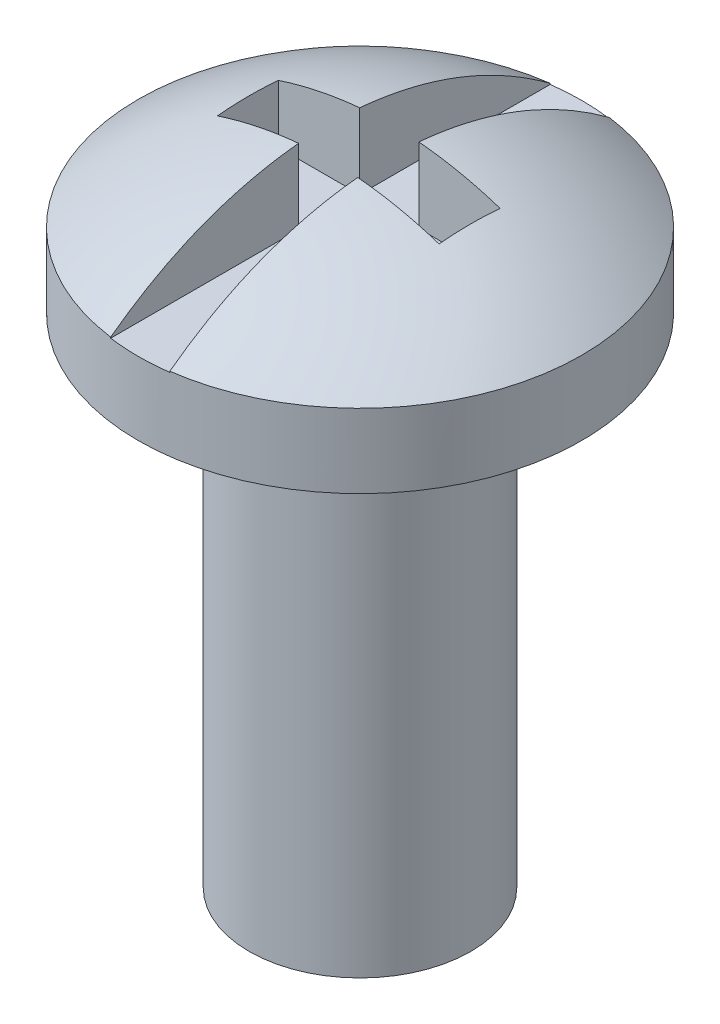
ISO-10303-21;
HEADER;
FILE_DESCRIPTION(('STEP AP214'),'2;1');
FILE_NAME('part.step','',(''),(''),'','','');
FILE_SCHEMA(('AUTOMOTIVE_DESIGN { 1 0 10303 214 1 1 1 1 }'));
ENDSEC;
DATA;
#1=APPLICATION_CONTEXT('core data for automotive mechanical design processes');
#2=APPLICATION_PROTOCOL_DEFINITION('international standard','automotive_design',2000,#1);
#3=PRODUCT_CONTEXT('',#1,'mechanical');
#4=PRODUCT('Part','Part','',(#3));
#5=PRODUCT_RELATED_PRODUCT_CATEGORY('part','',(#4));
#6=PRODUCT_DEFINITION_FORMATION('','',#4);
#7=PRODUCT_DEFINITION_CONTEXT('part definition',#1,'design');
#8=PRODUCT_DEFINITION('design','',#6,#7);
#9=PRODUCT_DEFINITION_SHAPE('','',#8);
#10=(LENGTH_UNIT() NAMED_UNIT(*) SI_UNIT(.MILLI.,.METRE.));
#11=(NAMED_UNIT(*) PLANE_ANGLE_UNIT() SI_UNIT($,.RADIAN.));
#12=(NAMED_UNIT(*) SI_UNIT($,.STERADIAN.) SOLID_ANGLE_UNIT());
#13=UNCERTAINTY_MEASURE_WITH_UNIT(LENGTH_MEASURE(1.E-05),#10,'distance_accuracy_value','');
#14=(GEOMETRIC_REPRESENTATION_CONTEXT(3) GLOBAL_UNCERTAINTY_ASSIGNED_CONTEXT((#13)) GLOBAL_UNIT_ASSIGNED_CONTEXT((#10,
#11,#12)) REPRESENTATION_CONTEXT('',''));
#15=CARTESIAN_POINT('',(0.,0.,0.));
#16=DIRECTION('',(0.,0.,1.));
#17=DIRECTION('',(1.,0.,0.));
#18=AXIS2_PLACEMENT_3D('',#15,#16,#17);
#19=CARTESIAN_POINT('',(0.,1.05624720814746,0.));
#20=CARTESIAN_POINT('',(-1.65504595994143,1.02014151907972,0.));
#21=CARTESIAN_POINT('',(-2.99999999999999,0.0131313521263424,0.));
#22=B_SPLINE_CURVE_WITH_KNOTS('',2,(#19,#20,#21),.UNSPECIFIED.,.F.,.F.,(3,3),(0.,
0.690587556508818),.UNSPECIFIED.);
#23=CARTESIAN_POINT('',(0.,54.4769452525927,0.));
#24=DIRECTION('',(0.,1.,0.));
#25=AXIS1_PLACEMENT('',#23,#24);
#26=SURFACE_OF_REVOLUTION('',#22,#25);
#27=CARTESIAN_POINT('',(1.5,0.783289571251429,0.430409259743653));
#28=CARTESIAN_POINT('',(1.3466391247065,0.833941776803077,0.430409259743659));
#29=CARTESIAN_POINT('',(1.19072307643197,0.877033538968349,0.430409259743657));
#30=CARTESIAN_POINT('',(0.876299651897131,0.947523998620973,0.43040925974365));
#31=CARTESIAN_POINT('',(0.717811639327711,0.975009095165208,0.430409259743646));
#32=CARTESIAN_POINT('',(0.50569781423859,1.00114357564236,0.430409259743649));
#33=CARTESIAN_POINT('',(0.452884215118986,1.00678042463389,0.43040925974365));
#34=CARTESIAN_POINT('',(0.39999999999999,1.01155260292836,0.430409259743653));
#35=B_SPLINE_CURVE_WITH_KNOTS('',3,(#27,#28,#29,#30,#31,#32,#33,#34),.UNSPECIFIED.,.F.,.F.,(4,2,
2,4),(0.,0.4844448005527,0.966180874368142,1.12549189581723),.UNSPECIFIED.);
#36=CARTESIAN_POINT('',(1.5,0.783289571251429,0.430409259743653));
#37=VERTEX_POINT('',#36);
#38=CARTESIAN_POINT('',(0.400000000000001,1.01155260292836,0.430409259743653));
#39=VERTEX_POINT('',#38);
#40=EDGE_CURVE('E11',#37,#39,#35,.T.);
#41=ORIENTED_EDGE('',*,*,#40,.T.);
#42=CARTESIAN_POINT('',(0.400000000000001,1.01155260292836,0.430409259743653));
#43=CARTESIAN_POINT('',(0.400000000000001,1.00425074679952,0.505657596346426));
#44=CARTESIAN_POINT('',(0.400000000000001,0.995209486998079,0.58073542753754));
#45=CARTESIAN_POINT('',(0.400000000000001,0.973689293816939,0.730387537298188));
#46=CARTESIAN_POINT('',(0.400000000000001,0.961210781161484,0.80496187635203));
#47=CARTESIAN_POINT('',(0.400000000000001,0.933029534566896,0.952551031900024));
#48=CARTESIAN_POINT('',(0.400000000000001,0.917368281483544,1.02557375320249));
#49=CARTESIAN_POINT('',(0.400000000000001,0.882744893862674,1.17083770489729));
#50=CARTESIAN_POINT('',(0.400000000000001,0.863782271788907,1.24307881818812));
#51=CARTESIAN_POINT('',(0.400000000000001,0.800870462385377,1.46225182002903));
#52=CARTESIAN_POINT('',(0.400000000000001,0.75164086595195,1.60770809256805));
#53=CARTESIAN_POINT('',(0.400000000000001,0.639863646969604,1.89350266130827));
#54=CARTESIAN_POINT('',(0.400000000000001,0.577305155645242,2.03383667061332));
#55=CARTESIAN_POINT('',(0.400000000000001,0.438046557607226,2.31183343502476));
#56=CARTESIAN_POINT('',(0.400000000000001,0.361025171343869,2.44933560907898));
#57=CARTESIAN_POINT('',(0.400000000000001,0.236794923851009,2.65003307593094));
#58=CARTESIAN_POINT('',(0.400000000000001,0.193954802753135,2.71597994762657));
#59=CARTESIAN_POINT('',(0.400000000000001,0.105547183660501,2.84600332544675));
#60=CARTESIAN_POINT('',(0.400000000000001,0.0599801742261693,2.91008016357184));
#61=CARTESIAN_POINT('',(0.400000000000001,0.0131313521263424,2.97321374946369));
#62=B_SPLINE_CURVE_WITH_KNOTS('',3,(#42,#43,#44,#45,#46,#47,#48,#49,#50,#51,#52,#53,#54,#55,#56,
#57,#58,#59,#60,#61),.UNSPECIFIED.,.F.,.F.,(4,2,2,2,2,2,2,2,2,4),(0.,0.226782284458679,
0.453536822794671,0.677506450695945,0.901509181857664,1.3614544654574,1.82177624735166,
2.29389289523833,2.52975478003197,2.76557453263477),.UNSPECIFIED.);
#63=CARTESIAN_POINT('',(0.400000000000001,0.0131313521263415,2.97321374946369));
#64=VERTEX_POINT('',#63);
#65=EDGE_CURVE('E132',#39,#64,#62,.T.);
#66=ORIENTED_EDGE('',*,*,#65,.T.);
#67=CARTESIAN_POINT('',(0.,0.0131313521263415,0.));
#68=DIRECTION('',(0.,1.,0.));
#69=DIRECTION('',(0.,0.,1.));
#70=AXIS2_PLACEMENT_3D('',#67,#68,#69);
#71=CIRCLE('',#70,2.99999999999999);
#72=CARTESIAN_POINT('',(0.4,0.0131313521263415,-2.97321374946369));
#73=VERTEX_POINT('',#72);
#74=EDGE_CURVE('E324',#64,#73,#71,.T.);
#75=ORIENTED_EDGE('',*,*,#74,.T.);
#76=CARTESIAN_POINT('',(0.4,0.013131352126342,-2.97321374946369));
#77=CARTESIAN_POINT('',(0.400000000000001,0.113835718494808,-2.83757097844883));
#78=CARTESIAN_POINT('',(0.4,0.208577884231259,-2.69749190479062));
#79=CARTESIAN_POINT('',(0.4,0.339925015446915,-2.48217851347155));
#80=CARTESIAN_POINT('',(0.4,0.381665388531384,-2.41004816713678));
#81=CARTESIAN_POINT('',(0.4,0.461650203549989,-2.26385913894055));
#82=CARTESIAN_POINT('',(0.400000000000001,0.499894096005798,-2.18980015633196));
#83=CARTESIAN_POINT('',(0.400000000000001,0.600813616496412,-1.98198757256186));
#84=CARTESIAN_POINT('',(0.4,0.659554102390821,-1.84629352675607));
#85=CARTESIAN_POINT('',(0.4,0.764662564875223,-1.57014139986353));
#86=CARTESIAN_POINT('',(0.4,0.811025337738785,-1.42968134297487));
#87=CARTESIAN_POINT('',(0.4,0.891877911851409,-1.14171151190978));
#88=CARTESIAN_POINT('',(0.4,0.926053602165833,-0.994113400232879));
#89=CARTESIAN_POINT('',(0.4,0.980729999187133,-0.696417984508175));
#90=CARTESIAN_POINT('',(0.4,1.0012318482514,-0.54632089030765));
#91=CARTESIAN_POINT('',(0.400000000000001,1.01479556007135,-0.39560585054899));
#92=B_SPLINE_CURVE_WITH_KNOTS('',3,(#76,#77,#78,#79,#80,#81,#82,#83,#84,#85,#86,#87,#88,#89,#90,
#91),.UNSPECIFIED.,.F.,.F.,(4,2,2,2,2,2,2,4),(0.,0.50659170584198,0.756518211062741,
1.00648392542032,1.44944984227423,1.89260169464805,2.34646630417434,2.80029299161653),.UNSPECIFIED.);
#93=CARTESIAN_POINT('',(0.4,1.01479556007135,-0.39560585054899));
#94=VERTEX_POINT('',#93);
#95=EDGE_CURVE('E256',#73,#94,#92,.T.);
#96=ORIENTED_EDGE('',*,*,#95,.T.);
#97=CARTESIAN_POINT('',(0.4,1.01479556007135,-0.39560585054899));
#98=CARTESIAN_POINT('',(0.549098771798424,1.00124330316207,-0.39560585054899));
#99=CARTESIAN_POINT('',(0.697608561758349,0.980886434426537,-0.39560585054899));
#100=CARTESIAN_POINT('',(0.991411817871552,0.926934502781349,-0.39560585054899));
#101=CARTESIAN_POINT('',(1.13671791568161,0.89340820785117,-0.39560585054899));
#102=CARTESIAN_POINT('',(1.3539690518688,0.832784753519446,-0.39560585054899));
#103=CARTESIAN_POINT('',(1.42727155370484,0.810472286121609,-0.39560585054899));
#104=CARTESIAN_POINT('',(1.5,0.786454045439858,-0.39560585054899));
#105=B_SPLINE_CURVE_WITH_KNOTS('',3,(#97,#98,#99,#100,#101,#102,#103,#104),.UNSPECIFIED.,.F.,
.F.,(4,2,2,4),(0.,0.449046043208007,0.895777784162428,1.1255606403534),.UNSPECIFIED.);
#106=CARTESIAN_POINT('',(1.5,0.786454045439858,-0.39560585054899));
#107=VERTEX_POINT('',#106);
#108=EDGE_CURVE('E234',#94,#107,#105,.T.);
#109=ORIENTED_EDGE('',*,*,#108,.T.);
#110=CARTESIAN_POINT('',(1.5,0.786454045439858,-0.39560585054899));
#111=CARTESIAN_POINT('',(1.5,0.798425783812092,-0.257888781097871));
#112=CARTESIAN_POINT('',(1.5,0.80414794681584,-0.120195653847924));
#113=CARTESIAN_POINT('',(1.5,0.803093122086364,0.155142716249623));
#114=CARTESIAN_POINT('',(1.5,0.79631613435314,0.292787959097225));
#115=CARTESIAN_POINT('',(1.5,0.78328957125143,0.430409259743653));
#116=B_SPLINE_CURVE_WITH_KNOTS('',3,(#110,#111,#112,#113,#114,#115),.UNSPECIFIED.,.F.,.F.,(4,2,
4),(0.,0.413435924868416,0.826871849736832),.UNSPECIFIED.);
#117=EDGE_CURVE('E46',#107,#37,#116,.T.);
#118=ORIENTED_EDGE('',*,*,#117,.T.);
#119=EDGE_LOOP('',(#41,#66,#75,#96,#109,#118));
#120=FACE_BOUND('',#119,.T.);
#121=ADVANCED_FACE('F32',(#120),#26,.F.);
#122=CARTESIAN_POINT('',(-1.49999999999999,0.786454045439869,-0.395605850549037));
#123=CARTESIAN_POINT('',(-1.34666421706277,0.837078035331176,-0.395605850549013));
#124=CARTESIAN_POINT('',(-1.19077950750411,0.880140053645199,-0.395605850548998));
#125=CARTESIAN_POINT('',(-0.876421065619345,0.950613575159147,-0.395605850548981));
#126=CARTESIAN_POINT('',(-0.717966515504543,0.978110652678506,-0.39560585054898));
#127=CARTESIAN_POINT('',(-0.50582492540966,1.00432554074677,-0.395605850548985));
#128=CARTESIAN_POINT('',(-0.452947757187914,1.00999146096424,-0.395605850548987));
#129=CARTESIAN_POINT('',(-0.399999999999987,1.01479556007135,-0.395605850548989));
#130=B_SPLINE_CURVE_WITH_KNOTS('',3,(#122,#123,#124,#125,#126,#127,#128,#129),.UNSPECIFIED.,.F.,
.F.,(4,2,2,4),(0.,0.484338165759318,0.965986965728526,1.125496907751),.UNSPECIFIED.);
#131=CARTESIAN_POINT('',(-1.5,0.786454045439869,-0.39560585054899));
#132=VERTEX_POINT('',#131);
#133=CARTESIAN_POINT('',(-0.4,1.01479556007135,-0.39560585054899));
#134=VERTEX_POINT('',#133);
#135=EDGE_CURVE('E227',#132,#134,#130,.T.);
#136=ORIENTED_EDGE('',*,*,#135,.T.);
#137=CARTESIAN_POINT('',(-0.4,1.01479556007135,-0.39560585054899));
#138=CARTESIAN_POINT('',(-0.4,1.00812450546121,-0.46993658968422));
#139=CARTESIAN_POINT('',(-0.4,0.999752556517969,-0.544101921640514));
#140=CARTESIAN_POINT('',(-0.4,0.979649123102281,-0.691962319332855));
#141=CARTESIAN_POINT('',(-0.4,0.967918248848191,-0.765657468003684));
#142=CARTESIAN_POINT('',(-0.4,0.927707396511351,-0.986080707721143));
#143=CARTESIAN_POINT('',(-0.4,0.894228650445375,-1.13193148048177));
#144=CARTESIAN_POINT('',(-0.4,0.816766836851975,-1.41044167638845));
#145=CARTESIAN_POINT('',(-0.399999999999999,0.773622477986334,-1.54333656904702));
#146=CARTESIAN_POINT('',(-0.4,0.676207470249333,-1.80505187754341));
#147=CARTESIAN_POINT('',(-0.400000000000001,0.621932194268059,-1.93387057312146));
#148=CARTESIAN_POINT('',(-0.399999999999998,0.502957219619231,-2.18647439864768));
#149=CARTESIAN_POINT('',(-0.399999999999995,0.438264530263261,-2.31026284352865));
#150=CARTESIAN_POINT('',(-0.400000000000005,0.299308960679265,-2.55227032799066));
#151=CARTESIAN_POINT('',(-0.400000000000019,0.225050878684738,-2.67049211961179));
#152=CARTESIAN_POINT('',(-0.399999999999995,0.124906391603568,-2.81745691898785));
#153=CARTESIAN_POINT('',(-0.399999999999987,0.102972777262155,-2.84894504656958));
#154=CARTESIAN_POINT('',(-0.400000000000012,0.0585043204636868,-2.91143379537133));
#155=CARTESIAN_POINT('',(-0.400000000000045,0.0359702757207004,-2.9424349841788));
#156=CARTESIAN_POINT('',(-0.400000000000121,0.0131313521263424,-2.97321374946367));
#157=B_SPLINE_CURVE_WITH_KNOTS('',3,(#137,#138,#139,#140,#141,#142,#143,#144,#145,#146,#147,
#148,#149,#150,#151,#152,#153,#154,#155,#156),.UNSPECIFIED.,.F.,.F.,(4,2,2,2,2,2,2,2,2,4),(0.,
0.22384419171404,0.447647743267862,0.895900452706192,1.31458079828997,1.73343554290504,
2.15200963153011,2.57037456496726,2.68549299872071,2.80046544627719),.UNSPECIFIED.);
#158=CARTESIAN_POINT('',(-0.4,0.0131313521263415,-2.97321374946369));
#159=VERTEX_POINT('',#158);
#160=EDGE_CURVE('E188',#134,#159,#157,.T.);
#161=ORIENTED_EDGE('',*,*,#160,.T.);
#162=CARTESIAN_POINT('',(-0.399999999999999,0.0131313521263415,2.97321374946369));
#163=VERTEX_POINT('',#162);
#164=EDGE_CURVE('E325',#159,#163,#71,.T.);
#165=ORIENTED_EDGE('',*,*,#164,.T.);
#166=CARTESIAN_POINT('',(-0.399999999999999,0.013131352126342,2.97321374946369));
#167=CARTESIAN_POINT('',(-0.399999999999999,0.063455935505022,2.90539634514298));
#168=CARTESIAN_POINT('',(-0.399999999999999,0.112300943408227,2.83649083768303));
#169=CARTESIAN_POINT('',(-0.399999999999999,0.20683130610373,2.69652425416402));
#170=CARTESIAN_POINT('',(-0.399999999999999,0.252515944703595,2.62546269472225));
#171=CARTESIAN_POINT('',(-0.399999999999999,0.383290325442273,2.41109672519236));
#172=CARTESIAN_POINT('',(-0.399999999999999,0.4634894938177,2.26475040031191));
#173=CARTESIAN_POINT('',(-0.399999999999999,0.59959996253813,1.98449870767113));
#174=CARTESIAN_POINT('',(-0.399999999999999,0.657315373651786,1.85146484937576));
#175=CARTESIAN_POINT('',(-0.399999999999999,0.760870134565488,1.58077558715704));
#176=CARTESIAN_POINT('',(-0.399999999999999,0.806704798669709,1.44311838391771));
#177=CARTESIAN_POINT('',(-0.399999999999999,0.886953862750404,1.16103066869166));
#178=CARTESIAN_POINT('',(-0.399999999999999,0.921076003152791,1.0165170386149));
#179=CARTESIAN_POINT('',(-0.399999999999999,0.976199449059138,0.725019350297646));
#180=CARTESIAN_POINT('',(-0.399999999999999,0.99720174278009,0.578035478978009));
#181=CARTESIAN_POINT('',(-0.399999999999999,1.01155260292836,0.430409259743654));
#182=B_SPLINE_CURVE_WITH_KNOTS('',3,(#166,#167,#168,#169,#170,#171,#172,#173,#174,#175,#176,
#177,#178,#179,#180,#181),.UNSPECIFIED.,.F.,.F.,(4,2,2,2,2,2,2,4),(0.,0.25330962657761,
0.506676470560873,1.00647076979279,1.44098877682503,1.87567789531587,2.32053643724222,
2.76536146735972),.UNSPECIFIED.);
#183=CARTESIAN_POINT('',(-0.399999999999999,1.01155260292836,0.430409259743653));
#184=VERTEX_POINT('',#183);
#185=EDGE_CURVE('E134',#163,#184,#182,.T.);
#186=ORIENTED_EDGE('',*,*,#185,.T.);
#187=CARTESIAN_POINT('',(-0.399999999999999,1.01155260292836,0.430409259743653));
#188=CARTESIAN_POINT('',(-0.550033452093379,0.997986508466372,0.430409259743653));
#189=CARTESIAN_POINT('',(-0.699468705270945,0.977494437461074,0.430409259743653));
#190=CARTESIAN_POINT('',(-0.995065570131902,0.92306614440351,0.430409259743654));
#191=CARTESIAN_POINT('',(-1.14124017746093,0.8892004928565,0.430409259743654));
#192=CARTESIAN_POINT('',(-1.35751740775321,0.828560295420051,0.430409259743654));
#193=CARTESIAN_POINT('',(-1.42903260135963,0.806737048014389,0.430409259743654));
#194=CARTESIAN_POINT('',(-1.5,0.783289571251429,0.430409259743654));
#195=B_SPLINE_CURVE_WITH_KNOTS('',3,(#187,#188,#189,#190,#191,#192,#193,#194),.UNSPECIFIED.,.F.,
.F.,(4,2,2,4),(0.,0.451836489190346,0.901319894841554,1.12555133875907),.UNSPECIFIED.);
#196=CARTESIAN_POINT('',(-1.5,0.783289571251454,0.430409259743654));
#197=VERTEX_POINT('',#196);
#198=EDGE_CURVE('E210',#184,#197,#195,.T.);
#199=ORIENTED_EDGE('',*,*,#198,.T.);
#200=CARTESIAN_POINT('',(-1.50000000000001,0.783289571251454,0.430409259743598));
#201=CARTESIAN_POINT('',(-1.5,0.796316134353151,0.29278795909717));
#202=CARTESIAN_POINT('',(-1.5,0.803093122086366,0.15514271624957));
#203=CARTESIAN_POINT('',(-1.5,0.804147946815832,-0.120195653847976));
#204=CARTESIAN_POINT('',(-1.5,0.798425783812084,-0.257888781097921));
#205=CARTESIAN_POINT('',(-1.5,0.786454045439854,-0.395605850549038));
#206=B_SPLINE_CURVE_WITH_KNOTS('',3,(#200,#201,#202,#203,#204,#205),.UNSPECIFIED.,.F.,.F.,(4,2,
4),(0.,0.413435924868412,0.826871849736824),.UNSPECIFIED.);
#207=EDGE_CURVE('E218',#197,#132,#206,.T.);
#208=ORIENTED_EDGE('',*,*,#207,.T.);
#209=EDGE_LOOP('',(#136,#161,#165,#186,#199,#208));
#210=FACE_BOUND('',#209,.T.);
#211=ADVANCED_FACE('F290',(#210),#26,.F.);
#212=CARTESIAN_POINT('',(0.,54.4769452525927,0.));
#213=DIRECTION('',(0.,1.,0.));
#214=DIRECTION('',(0.,0.,1.));
#215=AXIS2_PLACEMENT_3D('',#212,#213,#214);
#216=CYLINDRICAL_SURFACE('',#215,2.99999999999999);
#217=CARTESIAN_POINT('',(0.,-0.986868647873659,0.));
#218=DIRECTION('',(0.,1.,0.));
#219=DIRECTION('',(0.,0.,1.));
#220=AXIS2_PLACEMENT_3D('',#217,#218,#219);
#221=CIRCLE('',#220,2.99999999999999);
#222=CARTESIAN_POINT('',(0.,-0.986868647873659,2.99999999999999));
#223=VERTEX_POINT('',#222);
#224=EDGE_CURVE('E331',#223,#223,#221,.T.);
#225=ORIENTED_EDGE('',*,*,#224,.T.);
#226=EDGE_LOOP('',(#225));
#227=FACE_BOUND('',#226,.T.);
#228=CARTESIAN_POINT('',(0.,0.,0.));
#229=DIRECTION('',(0.,1.,0.));
#230=DIRECTION('',(0.,0.,1.));
#231=AXIS2_PLACEMENT_3D('',#228,#229,#230);
#232=CIRCLE('',#231,2.99999999999999);
#233=CARTESIAN_POINT('',(-0.4,0.,-2.97321374946369));
#234=VERTEX_POINT('',#233);
#235=CARTESIAN_POINT('',(0.4,0.,-2.97321374946369));
#236=VERTEX_POINT('',#235);
#237=EDGE_CURVE('E329',#234,#236,#232,.F.);
#238=ORIENTED_EDGE('',*,*,#237,.T.);
#239=DIRECTION('',(0.,1.,0.));
#240=VECTOR('',#239,1.);
#241=CARTESIAN_POINT('',(0.4,54.4769452525927,-2.97321374946369));
#242=LINE('',#241,#240);
#243=EDGE_CURVE('E219',#236,#73,#242,.T.);
#244=ORIENTED_EDGE('',*,*,#243,.T.);
#245=ORIENTED_EDGE('',*,*,#74,.F.);
#246=DIRECTION('',(0.,1.,0.));
#247=VECTOR('',#246,1.);
#248=CARTESIAN_POINT('',(0.400000000000001,54.4769452525927,2.97321374946369));
#249=LINE('',#248,#247);
#250=CARTESIAN_POINT('',(0.400000000000001,0.,2.97321374946369));
#251=VERTEX_POINT('',#250);
#252=EDGE_CURVE('E337',#64,#251,#249,.F.);
#253=ORIENTED_EDGE('',*,*,#252,.T.);
#254=CARTESIAN_POINT('',(-0.399999999999999,0.,2.97321374946369));
#255=VERTEX_POINT('',#254);
#256=EDGE_CURVE('E144',#251,#255,#232,.F.);
#257=ORIENTED_EDGE('',*,*,#256,.T.);
#258=DIRECTION('',(0.,1.,0.));
#259=VECTOR('',#258,1.);
#260=CARTESIAN_POINT('',(-0.399999999999999,54.4769452525927,2.97321374946369));
#261=LINE('',#260,#259);
#262=EDGE_CURVE('E327',#255,#163,#261,.T.);
#263=ORIENTED_EDGE('',*,*,#262,.T.);
#264=ORIENTED_EDGE('',*,*,#164,.F.);
#265=DIRECTION('',(0.,1.,0.));
#266=VECTOR('',#265,1.);
#267=CARTESIAN_POINT('',(-0.4,54.4769452525927,-2.97321374946369));
#268=LINE('',#267,#266);
#269=EDGE_CURVE('E338',#159,#234,#268,.F.);
#270=ORIENTED_EDGE('',*,*,#269,.T.);
#271=EDGE_LOOP('',(#238,#244,#245,#253,#257,#263,#264,#270));
#272=FACE_BOUND('',#271,.T.);
#273=ADVANCED_FACE('F287',(#227,#272),#216,.T.);
#274=CARTESIAN_POINT('',(-2.99999999999999,-0.986868647873658,0.));
#275=DIRECTION('',(0.,-1.,0.));
#276=DIRECTION('',(0.,0.,-1.));
#277=AXIS2_PLACEMENT_3D('',#274,#275,#276);
#278=PLANE('',#277);
#279=CARTESIAN_POINT('',(0.,-0.986868647873659,0.));
#280=DIRECTION('',(0.,1.,0.));
#281=DIRECTION('',(0.,0.,1.));
#282=AXIS2_PLACEMENT_3D('',#279,#280,#281);
#283=CIRCLE('',#282,1.49999999999999);
#284=CARTESIAN_POINT('',(0.,-0.986868647873659,1.49999999999999));
#285=VERTEX_POINT('',#284);
#286=EDGE_CURVE('E450',#285,#285,#283,.T.);
#287=ORIENTED_EDGE('',*,*,#286,.T.);
#288=EDGE_LOOP('',(#287));
#289=FACE_BOUND('',#288,.T.);
#290=ORIENTED_EDGE('',*,*,#224,.F.);
#291=EDGE_LOOP('',(#290));
#292=FACE_BOUND('',#291,.T.);
#293=ADVANCED_FACE('F284',(#289,#292),#278,.T.);
#294=CARTESIAN_POINT('',(0.,54.4769452525927,0.));
#295=DIRECTION('',(0.,1.,0.));
#296=DIRECTION('',(0.,0.,1.));
#297=AXIS2_PLACEMENT_3D('',#294,#295,#296);
#298=CYLINDRICAL_SURFACE('',#297,1.49999999999999);
#299=CARTESIAN_POINT('',(0.,-7.72216125661043,0.));
#300=DIRECTION('',(0.,1.,0.));
#301=DIRECTION('',(0.,0.,1.));
#302=AXIS2_PLACEMENT_3D('',#299,#300,#301);
#303=CIRCLE('',#302,1.49999999999999);
#304=CARTESIAN_POINT('',(0.,-7.72216125661043,1.49999999999999));
#305=VERTEX_POINT('',#304);
#306=EDGE_CURVE('E268',#305,#305,#303,.T.);
#307=ORIENTED_EDGE('',*,*,#306,.T.);
#308=EDGE_LOOP('',(#307));
#309=FACE_BOUND('',#308,.T.);
#310=ORIENTED_EDGE('',*,*,#286,.F.);
#311=EDGE_LOOP('',(#310));
#312=FACE_BOUND('',#311,.T.);
#313=ADVANCED_FACE('F280',(#309,#312),#298,.T.);
#314=CARTESIAN_POINT('',(-1.49999999999999,-7.72216125661043,0.));
#315=DIRECTION('',(0.,-1.,0.));
#316=DIRECTION('',(0.,0.,-1.));
#317=AXIS2_PLACEMENT_3D('',#314,#315,#316);
#318=PLANE('',#317);
#319=ORIENTED_EDGE('',*,*,#306,.F.);
#320=EDGE_LOOP('',(#319));
#321=FACE_BOUND('',#320,.T.);
#322=ADVANCED_FACE('F276',(#321),#318,.T.);
#323=CARTESIAN_POINT('',(0.400000000000001,1.05624720814746,0.430409259743653));
#324=DIRECTION('',(-1.,0.,0.));
#325=DIRECTION('',(0.,0.,1.));
#326=AXIS2_PLACEMENT_3D('',#323,#324,#325);
#327=PLANE('',#326);
#328=DIRECTION('',(0.,-1.,0.));
#329=VECTOR('',#328,1.);
#330=CARTESIAN_POINT('',(0.400000000000001,1.05624720814746,0.430409259743653));
#331=LINE('',#330,#329);
#332=CARTESIAN_POINT('',(0.400000000000001,0.,0.430409259743653));
#333=VERTEX_POINT('',#332);
#334=EDGE_CURVE('E126',#39,#333,#331,.T.);
#335=ORIENTED_EDGE('',*,*,#334,.T.);
#336=DIRECTION('',(0.,0.,-1.));
#337=VECTOR('',#336,1.);
#338=CARTESIAN_POINT('',(0.400000000000001,0.,0.430409259743653));
#339=LINE('',#338,#337);
#340=EDGE_CURVE('E129',#251,#333,#339,.T.);
#341=ORIENTED_EDGE('',*,*,#340,.F.);
#342=ORIENTED_EDGE('',*,*,#252,.F.);
#343=ORIENTED_EDGE('',*,*,#65,.F.);
#344=EDGE_LOOP('',(#335,#341,#342,#343));
#345=FACE_BOUND('',#344,.T.);
#346=ADVANCED_FACE('F128',(#345),#327,.T.);
#347=CARTESIAN_POINT('',(0.400000000000001,1.05624720814746,0.430409259743653));
#348=DIRECTION('',(0.,0.,-1.));
#349=DIRECTION('',(-1.,0.,0.));
#350=AXIS2_PLACEMENT_3D('',#347,#348,#349);
#351=PLANE('',#350);
#352=DIRECTION('',(0.,-1.,0.));
#353=VECTOR('',#352,1.);
#354=CARTESIAN_POINT('',(1.5,1.05624720814746,0.430409259743653));
#355=LINE('',#354,#353);
#356=CARTESIAN_POINT('',(1.5,0.,0.430409259743653));
#357=VERTEX_POINT('',#356);
#358=EDGE_CURVE('E135',#37,#357,#355,.T.);
#359=ORIENTED_EDGE('',*,*,#358,.T.);
#360=DIRECTION('',(1.,0.,0.));
#361=VECTOR('',#360,1.);
#362=CARTESIAN_POINT('',(0.400000000000001,0.,0.430409259743653));
#363=LINE('',#362,#361);
#364=EDGE_CURVE('E141',#333,#357,#363,.T.);
#365=ORIENTED_EDGE('',*,*,#364,.F.);
#366=ORIENTED_EDGE('',*,*,#334,.F.);
#367=ORIENTED_EDGE('',*,*,#40,.F.);
#368=EDGE_LOOP('',(#359,#365,#366,#367));
#369=FACE_BOUND('',#368,.T.);
#370=ADVANCED_FACE('F146',(#369),#351,.T.);
#371=CARTESIAN_POINT('',(1.5,1.05624720814746,-0.39560585054899));
#372=DIRECTION('',(-1.,0.,0.));
#373=DIRECTION('',(0.,0.,1.));
#374=AXIS2_PLACEMENT_3D('',#371,#372,#373);
#375=PLANE('',#374);
#376=DIRECTION('',(0.,-1.,0.));
#377=VECTOR('',#376,1.);
#378=CARTESIAN_POINT('',(1.5,1.05624720814746,-0.39560585054899));
#379=LINE('',#378,#377);
#380=CARTESIAN_POINT('',(1.5,0.,-0.39560585054899));
#381=VERTEX_POINT('',#380);
#382=EDGE_CURVE('E178',#107,#381,#379,.T.);
#383=ORIENTED_EDGE('',*,*,#382,.T.);
#384=DIRECTION('',(0.,0.,-1.));
#385=VECTOR('',#384,1.);
#386=CARTESIAN_POINT('',(1.5,0.,-0.39560585054899));
#387=LINE('',#386,#385);
#388=EDGE_CURVE('E147',#357,#381,#387,.T.);
#389=ORIENTED_EDGE('',*,*,#388,.F.);
#390=ORIENTED_EDGE('',*,*,#358,.F.);
#391=ORIENTED_EDGE('',*,*,#117,.F.);
#392=EDGE_LOOP('',(#383,#389,#390,#391));
#393=FACE_BOUND('',#392,.T.);
#394=ADVANCED_FACE('F312',(#393),#375,.T.);
#395=CARTESIAN_POINT('',(0.4,1.05624720814746,-0.39560585054899));
#396=DIRECTION('',(0.,0.,1.));
#397=DIRECTION('',(1.,0.,0.));
#398=AXIS2_PLACEMENT_3D('',#395,#396,#397);
#399=PLANE('',#398);
#400=DIRECTION('',(0.,-1.,0.));
#401=VECTOR('',#400,1.);
#402=CARTESIAN_POINT('',(0.4,1.05624720814746,-0.39560585054899));
#403=LINE('',#402,#401);
#404=CARTESIAN_POINT('',(0.4,0.,-0.39560585054899));
#405=VERTEX_POINT('',#404);
#406=EDGE_CURVE('E176',#94,#405,#403,.T.);
#407=ORIENTED_EDGE('',*,*,#406,.T.);
#408=DIRECTION('',(-1.,0.,0.));
#409=VECTOR('',#408,1.);
#410=CARTESIAN_POINT('',(0.4,0.,-0.39560585054899));
#411=LINE('',#410,#409);
#412=EDGE_CURVE('E149',#381,#405,#411,.T.);
#413=ORIENTED_EDGE('',*,*,#412,.F.);
#414=ORIENTED_EDGE('',*,*,#382,.F.);
#415=ORIENTED_EDGE('',*,*,#108,.F.);
#416=EDGE_LOOP('',(#407,#413,#414,#415));
#417=FACE_BOUND('',#416,.T.);
#418=ADVANCED_FACE('F252',(#417),#399,.T.);
#419=CARTESIAN_POINT('',(0.4,1.05624720814746,-3.57366398675967));
#420=DIRECTION('',(-1.,0.,0.));
#421=DIRECTION('',(0.,0.,1.));
#422=AXIS2_PLACEMENT_3D('',#419,#420,#421);
#423=PLANE('',#422);
#424=ORIENTED_EDGE('',*,*,#243,.F.);
#425=DIRECTION('',(0.,0.,-1.));
#426=VECTOR('',#425,1.);
#427=CARTESIAN_POINT('',(0.4,0.,-3.57366398675967));
#428=LINE('',#427,#426);
#429=EDGE_CURVE('E154',#405,#236,#428,.T.);
#430=ORIENTED_EDGE('',*,*,#429,.F.);
#431=ORIENTED_EDGE('',*,*,#406,.F.);
#432=ORIENTED_EDGE('',*,*,#95,.F.);
#433=EDGE_LOOP('',(#424,#430,#431,#432));
#434=FACE_BOUND('',#433,.T.);
#435=ADVANCED_FACE('F248',(#434),#423,.T.);
#436=CARTESIAN_POINT('',(-0.4,1.05624720814746,-3.57366398675967));
#437=DIRECTION('',(1.,0.,0.));
#438=DIRECTION('',(0.,0.,-1.));
#439=AXIS2_PLACEMENT_3D('',#436,#437,#438);
#440=PLANE('',#439);
#441=DIRECTION('',(0.,-1.,0.));
#442=VECTOR('',#441,1.);
#443=CARTESIAN_POINT('',(-0.4,1.05624720814746,-0.39560585054899));
#444=LINE('',#443,#442);
#445=CARTESIAN_POINT('',(-0.4,0.,-0.39560585054899));
#446=VERTEX_POINT('',#445);
#447=EDGE_CURVE('E174',#134,#446,#444,.T.);
#448=ORIENTED_EDGE('',*,*,#447,.T.);
#449=DIRECTION('',(0.,0.,1.));
#450=VECTOR('',#449,1.);
#451=CARTESIAN_POINT('',(-0.4,0.,-3.57366398675967));
#452=LINE('',#451,#450);
#453=EDGE_CURVE('E157',#234,#446,#452,.T.);
#454=ORIENTED_EDGE('',*,*,#453,.F.);
#455=ORIENTED_EDGE('',*,*,#269,.F.);
#456=ORIENTED_EDGE('',*,*,#160,.F.);
#457=EDGE_LOOP('',(#448,#454,#455,#456));
#458=FACE_BOUND('',#457,.T.);
#459=ADVANCED_FACE('F243',(#458),#440,.T.);
#460=CARTESIAN_POINT('',(-1.5,1.05624720814746,-0.39560585054899));
#461=DIRECTION('',(0.,0.,1.));
#462=DIRECTION('',(1.,0.,0.));
#463=AXIS2_PLACEMENT_3D('',#460,#461,#462);
#464=PLANE('',#463);
#465=DIRECTION('',(0.,-1.,0.));
#466=VECTOR('',#465,1.);
#467=CARTESIAN_POINT('',(-1.5,1.05624720814746,-0.39560585054899));
#468=LINE('',#467,#466);
#469=CARTESIAN_POINT('',(-1.5,0.,-0.39560585054899));
#470=VERTEX_POINT('',#469);
#471=EDGE_CURVE('E172',#132,#470,#468,.T.);
#472=ORIENTED_EDGE('',*,*,#471,.T.);
#473=DIRECTION('',(-1.,0.,0.));
#474=VECTOR('',#473,1.);
#475=CARTESIAN_POINT('',(-1.5,0.,-0.39560585054899));
#476=LINE('',#475,#474);
#477=EDGE_CURVE('E159',#446,#470,#476,.T.);
#478=ORIENTED_EDGE('',*,*,#477,.F.);
#479=ORIENTED_EDGE('',*,*,#447,.F.);
#480=ORIENTED_EDGE('',*,*,#135,.F.);
#481=EDGE_LOOP('',(#472,#478,#479,#480));
#482=FACE_BOUND('',#481,.T.);
#483=ADVANCED_FACE('F240',(#482),#464,.T.);
#484=CARTESIAN_POINT('',(-1.5,1.05624720814746,-0.39560585054899));
#485=DIRECTION('',(1.,0.,0.));
#486=DIRECTION('',(0.,0.,-1.));
#487=AXIS2_PLACEMENT_3D('',#484,#485,#486);
#488=PLANE('',#487);
#489=DIRECTION('',(0.,-1.,0.));
#490=VECTOR('',#489,1.);
#491=CARTESIAN_POINT('',(-1.5,1.05624720814746,0.430409259743654));
#492=LINE('',#491,#490);
#493=CARTESIAN_POINT('',(-1.5,0.,0.430409259743654));
#494=VERTEX_POINT('',#493);
#495=EDGE_CURVE('E170',#197,#494,#492,.T.);
#496=ORIENTED_EDGE('',*,*,#495,.T.);
#497=DIRECTION('',(0.,0.,1.));
#498=VECTOR('',#497,1.);
#499=CARTESIAN_POINT('',(-1.5,0.,-0.39560585054899));
#500=LINE('',#499,#498);
#501=EDGE_CURVE('E162',#470,#494,#500,.T.);
#502=ORIENTED_EDGE('',*,*,#501,.F.);
#503=ORIENTED_EDGE('',*,*,#471,.F.);
#504=ORIENTED_EDGE('',*,*,#207,.F.);
#505=EDGE_LOOP('',(#496,#502,#503,#504));
#506=FACE_BOUND('',#505,.T.);
#507=ADVANCED_FACE('F205',(#506),#488,.T.);
#508=CARTESIAN_POINT('',(-1.5,1.05624720814746,0.430409259743654));
#509=DIRECTION('',(0.,0.,-1.));
#510=DIRECTION('',(-1.,0.,0.));
#511=AXIS2_PLACEMENT_3D('',#508,#509,#510);
#512=PLANE('',#511);
#513=DIRECTION('',(0.,-1.,0.));
#514=VECTOR('',#513,1.);
#515=CARTESIAN_POINT('',(-0.399999999999999,1.05624720814746,0.430409259743653));
#516=LINE('',#515,#514);
#517=CARTESIAN_POINT('',(-0.399999999999999,0.,0.430409259743653));
#518=VERTEX_POINT('',#517);
#519=EDGE_CURVE('E168',#184,#518,#516,.T.);
#520=ORIENTED_EDGE('',*,*,#519,.T.);
#521=DIRECTION('',(1.,0.,0.));
#522=VECTOR('',#521,1.);
#523=CARTESIAN_POINT('',(-1.5,0.,0.430409259743654));
#524=LINE('',#523,#522);
#525=EDGE_CURVE('E165',#494,#518,#524,.T.);
#526=ORIENTED_EDGE('',*,*,#525,.F.);
#527=ORIENTED_EDGE('',*,*,#495,.F.);
#528=ORIENTED_EDGE('',*,*,#198,.F.);
#529=EDGE_LOOP('',(#520,#526,#527,#528));
#530=FACE_BOUND('',#529,.T.);
#531=ADVANCED_FACE('F200',(#530),#512,.T.);
#532=CARTESIAN_POINT('',(-0.399999999999999,1.05624720814746,0.430409259743653));
#533=DIRECTION('',(1.,0.,0.));
#534=DIRECTION('',(0.,0.,-1.));
#535=AXIS2_PLACEMENT_3D('',#532,#533,#534);
#536=PLANE('',#535);
#537=ORIENTED_EDGE('',*,*,#262,.F.);
#538=DIRECTION('',(0.,0.,1.));
#539=VECTOR('',#538,1.);
#540=CARTESIAN_POINT('',(-0.399999999999999,0.,0.430409259743653));
#541=LINE('',#540,#539);
#542=EDGE_CURVE('E53',#518,#255,#541,.T.);
#543=ORIENTED_EDGE('',*,*,#542,.F.);
#544=ORIENTED_EDGE('',*,*,#519,.F.);
#545=ORIENTED_EDGE('',*,*,#185,.F.);
#546=EDGE_LOOP('',(#537,#543,#544,#545));
#547=FACE_BOUND('',#546,.T.);
#548=ADVANCED_FACE('F195',(#547),#536,.T.);
#549=CARTESIAN_POINT('',(0.,0.,0.));
#550=DIRECTION('',(0.,1.,0.));
#551=DIRECTION('',(0.,0.,1.));
#552=AXIS2_PLACEMENT_3D('',#549,#550,#551);
#553=PLANE('',#552);
#554=ORIENTED_EDGE('',*,*,#453,.T.);
#555=ORIENTED_EDGE('',*,*,#477,.T.);
#556=ORIENTED_EDGE('',*,*,#501,.T.);
#557=ORIENTED_EDGE('',*,*,#525,.T.);
#558=ORIENTED_EDGE('',*,*,#542,.T.);
#559=ORIENTED_EDGE('',*,*,#256,.F.);
#560=ORIENTED_EDGE('',*,*,#340,.T.);
#561=ORIENTED_EDGE('',*,*,#364,.T.);
#562=ORIENTED_EDGE('',*,*,#388,.T.);
#563=ORIENTED_EDGE('',*,*,#412,.T.);
#564=ORIENTED_EDGE('',*,*,#429,.T.);
#565=ORIENTED_EDGE('',*,*,#237,.F.);
#566=EDGE_LOOP('',(#554,#555,#556,#557,#558,#559,#560,#561,#562,#563,#564,#565));
#567=FACE_BOUND('',#566,.T.);
#568=ADVANCED_FACE('F139',(#567),#553,.T.);
#569=CLOSED_SHELL('',(#121,#211,#273,#293,#313,#322,#346,#370,#394,#418,#435,#459,#483,#507,
#531,#548,#568));
#570=MANIFOLD_SOLID_BREP('B2',#569);
#571=ADVANCED_BREP_SHAPE_REPRESENTATION('',(#18,#570),#14);
#572=SHAPE_DEFINITION_REPRESENTATION(#9,#571);
ENDSEC;
END-ISO-10303-21;
